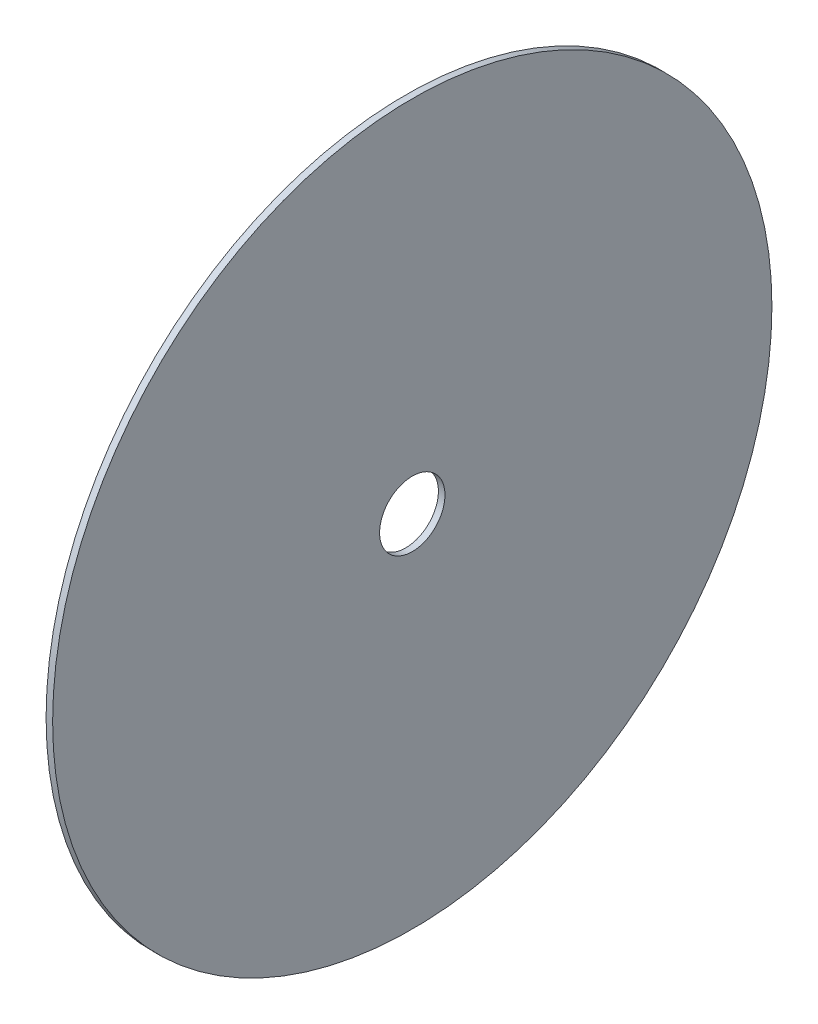
ISO-10303-21;
HEADER;
FILE_DESCRIPTION(('STEP AP214'),'2;1');
FILE_NAME('part.step','',(''),(''),'','','');
FILE_SCHEMA(('AUTOMOTIVE_DESIGN { 1 0 10303 214 1 1 1 1 }'));
ENDSEC;
DATA;
#1=APPLICATION_CONTEXT('core data for automotive mechanical design processes');
#2=APPLICATION_PROTOCOL_DEFINITION('international standard','automotive_design',2000,#1);
#3=PRODUCT_CONTEXT('',#1,'mechanical');
#4=PRODUCT('Part','Part','',(#3));
#5=PRODUCT_RELATED_PRODUCT_CATEGORY('part','',(#4));
#6=PRODUCT_DEFINITION_FORMATION('','',#4);
#7=PRODUCT_DEFINITION_CONTEXT('part definition',#1,'design');
#8=PRODUCT_DEFINITION('design','',#6,#7);
#9=PRODUCT_DEFINITION_SHAPE('','',#8);
#10=(LENGTH_UNIT() NAMED_UNIT(*) SI_UNIT(.MILLI.,.METRE.));
#11=(NAMED_UNIT(*) PLANE_ANGLE_UNIT() SI_UNIT($,.RADIAN.));
#12=(NAMED_UNIT(*) SI_UNIT($,.STERADIAN.) SOLID_ANGLE_UNIT());
#13=UNCERTAINTY_MEASURE_WITH_UNIT(LENGTH_MEASURE(1.E-05),#10,'distance_accuracy_value','');
#14=(GEOMETRIC_REPRESENTATION_CONTEXT(3) GLOBAL_UNCERTAINTY_ASSIGNED_CONTEXT((#13)) GLOBAL_UNIT_ASSIGNED_CONTEXT((#10,
#11,#12)) REPRESENTATION_CONTEXT('',''));
#15=CARTESIAN_POINT('',(0.,0.,0.));
#16=DIRECTION('',(0.,0.,1.));
#17=DIRECTION('',(1.,0.,0.));
#18=AXIS2_PLACEMENT_3D('',#15,#16,#17);
#19=CARTESIAN_POINT('',(2.,0.,0.));
#20=DIRECTION('',(1.,0.,0.));
#21=DIRECTION('',(0.,0.,-1.));
#22=AXIS2_PLACEMENT_3D('',#19,#20,#21);
#23=PLANE('',#22);
#24=CARTESIAN_POINT('',(2.,0.,0.));
#25=DIRECTION('',(1.,0.,0.));
#26=DIRECTION('',(0.,0.,-1.));
#27=AXIS2_PLACEMENT_3D('',#24,#25,#26);
#28=CIRCLE('',#27,110.);
#29=CARTESIAN_POINT('',(2.,0.,-110.));
#30=VERTEX_POINT('',#29);
#31=EDGE_CURVE('E10',#30,#30,#28,.T.);
#32=ORIENTED_EDGE('',*,*,#31,.T.);
#33=EDGE_LOOP('',(#32));
#34=FACE_BOUND('',#33,.T.);
#35=CARTESIAN_POINT('',(2.,0.,0.));
#36=DIRECTION('',(1.,0.,0.));
#37=DIRECTION('',(0.,0.,-1.));
#38=AXIS2_PLACEMENT_3D('',#35,#36,#37);
#39=CIRCLE('',#38,10.);
#40=CARTESIAN_POINT('',(2.,0.,-10.));
#41=VERTEX_POINT('',#40);
#42=EDGE_CURVE('E42',#41,#41,#39,.T.);
#43=ORIENTED_EDGE('',*,*,#42,.F.);
#44=EDGE_LOOP('',(#43));
#45=FACE_BOUND('',#44,.T.);
#46=ADVANCED_FACE('F31',(#34,#45),#23,.T.);
#47=CARTESIAN_POINT('',(0.,0.,0.));
#48=DIRECTION('',(1.,0.,0.));
#49=DIRECTION('',(0.,0.,-1.));
#50=AXIS2_PLACEMENT_3D('',#47,#48,#49);
#51=PLANE('',#50);
#52=CARTESIAN_POINT('',(0.,0.,0.));
#53=DIRECTION('',(1.,0.,0.));
#54=DIRECTION('',(0.,0.,-1.));
#55=AXIS2_PLACEMENT_3D('',#52,#53,#54);
#56=CIRCLE('',#55,110.);
#57=CARTESIAN_POINT('',(0.,0.,-110.));
#58=VERTEX_POINT('',#57);
#59=EDGE_CURVE('E35',#58,#58,#56,.T.);
#60=ORIENTED_EDGE('',*,*,#59,.F.);
#61=EDGE_LOOP('',(#60));
#62=FACE_BOUND('',#61,.T.);
#63=CARTESIAN_POINT('',(0.,0.,0.));
#64=DIRECTION('',(1.,0.,0.));
#65=DIRECTION('',(0.,0.,-1.));
#66=AXIS2_PLACEMENT_3D('',#63,#64,#65);
#67=CIRCLE('',#66,10.);
#68=CARTESIAN_POINT('',(0.,0.,-10.));
#69=VERTEX_POINT('',#68);
#70=EDGE_CURVE('E44',#69,#69,#67,.T.);
#71=ORIENTED_EDGE('',*,*,#70,.T.);
#72=EDGE_LOOP('',(#71));
#73=FACE_BOUND('',#72,.T.);
#74=ADVANCED_FACE('F54',(#62,#73),#51,.F.);
#75=CARTESIAN_POINT('',(2.,0.,0.));
#76=DIRECTION('',(-1.,0.,0.));
#77=DIRECTION('',(0.,0.,1.));
#78=AXIS2_PLACEMENT_3D('',#75,#76,#77);
#79=CYLINDRICAL_SURFACE('',#78,110.);
#80=ORIENTED_EDGE('',*,*,#31,.F.);
#81=EDGE_LOOP('',(#80));
#82=FACE_BOUND('',#81,.T.);
#83=ORIENTED_EDGE('',*,*,#59,.T.);
#84=EDGE_LOOP('',(#83));
#85=FACE_BOUND('',#84,.T.);
#86=ADVANCED_FACE('F33',(#82,#85),#79,.T.);
#87=CARTESIAN_POINT('',(2.,0.,0.));
#88=DIRECTION('',(-1.,0.,0.));
#89=DIRECTION('',(0.,0.,1.));
#90=AXIS2_PLACEMENT_3D('',#87,#88,#89);
#91=CYLINDRICAL_SURFACE('',#90,10.);
#92=ORIENTED_EDGE('',*,*,#42,.T.);
#93=EDGE_LOOP('',(#92));
#94=FACE_BOUND('',#93,.T.);
#95=ORIENTED_EDGE('',*,*,#70,.F.);
#96=EDGE_LOOP('',(#95));
#97=FACE_BOUND('',#96,.T.);
#98=ADVANCED_FACE('F50',(#94,#97),#91,.F.);
#99=CLOSED_SHELL('',(#46,#74,#86,#98));
#100=MANIFOLD_SOLID_BREP('B2',#99);
#101=ADVANCED_BREP_SHAPE_REPRESENTATION('',(#18,#100),#14);
#102=SHAPE_DEFINITION_REPRESENTATION(#9,#101);
ENDSEC;
END-ISO-10303-21;
